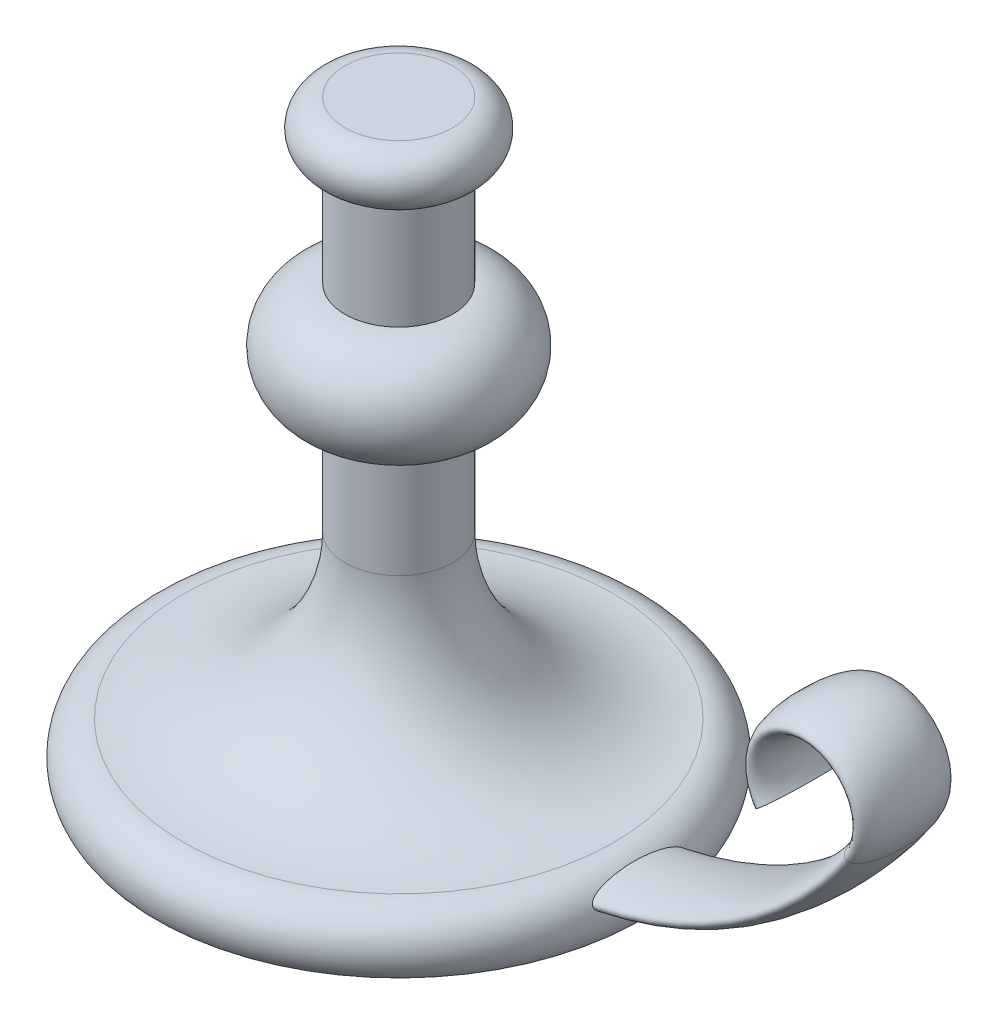
ISO-10303-21;
HEADER;
FILE_DESCRIPTION(('STEP AP214'),'2;1');
FILE_NAME('part.step','',(''),(''),'','','');
FILE_SCHEMA(('AUTOMOTIVE_DESIGN { 1 0 10303 214 1 1 1 1 }'));
ENDSEC;
DATA;
#1=APPLICATION_CONTEXT('core data for automotive mechanical design processes');
#2=APPLICATION_PROTOCOL_DEFINITION('international standard','automotive_design',2000,#1);
#3=PRODUCT_CONTEXT('',#1,'mechanical');
#4=PRODUCT('Part','Part','',(#3));
#5=PRODUCT_RELATED_PRODUCT_CATEGORY('part','',(#4));
#6=PRODUCT_DEFINITION_FORMATION('','',#4);
#7=PRODUCT_DEFINITION_CONTEXT('part definition',#1,'design');
#8=PRODUCT_DEFINITION('design','',#6,#7);
#9=PRODUCT_DEFINITION_SHAPE('','',#8);
#10=(LENGTH_UNIT() NAMED_UNIT(*) SI_UNIT(.MILLI.,.METRE.));
#11=(NAMED_UNIT(*) PLANE_ANGLE_UNIT() SI_UNIT($,.RADIAN.));
#12=(NAMED_UNIT(*) SI_UNIT($,.STERADIAN.) SOLID_ANGLE_UNIT());
#13=UNCERTAINTY_MEASURE_WITH_UNIT(LENGTH_MEASURE(1.E-05),#10,'distance_accuracy_value','');
#14=(GEOMETRIC_REPRESENTATION_CONTEXT(3) GLOBAL_UNCERTAINTY_ASSIGNED_CONTEXT((#13)) GLOBAL_UNIT_ASSIGNED_CONTEXT((#10,
#11,#12)) REPRESENTATION_CONTEXT('',''));
#15=CARTESIAN_POINT('',(0.,0.,0.));
#16=DIRECTION('',(0.,0.,1.));
#17=DIRECTION('',(1.,0.,0.));
#18=AXIS2_PLACEMENT_3D('',#15,#16,#17);
#19=CARTESIAN_POINT('',(0.,220.,0.));
#20=DIRECTION('',(0.,1.,0.));
#21=DIRECTION('',(0.,0.,1.));
#22=AXIS2_PLACEMENT_3D('',#19,#20,#21);
#23=PLANE('',#22);
#24=CARTESIAN_POINT('',(0.,220.,0.));
#25=DIRECTION('',(0.,-1.,0.));
#26=DIRECTION('',(0.,0.,-1.));
#27=AXIS2_PLACEMENT_3D('',#24,#25,#26);
#28=CIRCLE('',#27,20.);
#29=CARTESIAN_POINT('',(0.,220.,-20.));
#30=VERTEX_POINT('',#29);
#31=EDGE_CURVE('E40',#30,#30,#28,.T.);
#32=ORIENTED_EDGE('',*,*,#31,.F.);
#33=EDGE_LOOP('',(#32));
#34=FACE_BOUND('',#33,.T.);
#35=ADVANCED_FACE('F30',(#34),#23,.T.);
#36=CARTESIAN_POINT('',(0.,210.,0.));
#37=DIRECTION('',(0.,-1.,0.));
#38=DIRECTION('',(0.,0.,-1.));
#39=AXIS2_PLACEMENT_3D('',#36,#37,#38);
#40=TOROIDAL_SURFACE('',#39,20.,10.);
#41=ORIENTED_EDGE('',*,*,#31,.T.);
#42=EDGE_LOOP('',(#41));
#43=FACE_BOUND('',#42,.T.);
#44=CARTESIAN_POINT('',(0.,200.,0.));
#45=DIRECTION('',(0.,-1.,0.));
#46=DIRECTION('',(0.,0.,-1.));
#47=AXIS2_PLACEMENT_3D('',#44,#45,#46);
#48=CIRCLE('',#47,20.);
#49=CARTESIAN_POINT('',(0.,200.,-20.));
#50=VERTEX_POINT('',#49);
#51=EDGE_CURVE('E44',#50,#50,#48,.T.);
#52=ORIENTED_EDGE('',*,*,#51,.F.);
#53=EDGE_LOOP('',(#52));
#54=FACE_BOUND('',#53,.T.);
#55=ADVANCED_FACE('F103',(#43,#54),#40,.T.);
#56=CARTESIAN_POINT('',(0.,0.,0.));
#57=DIRECTION('',(0.,-1.,0.));
#58=DIRECTION('',(0.,0.,-1.));
#59=AXIS2_PLACEMENT_3D('',#56,#57,#58);
#60=CYLINDRICAL_SURFACE('',#59,20.);
#61=ORIENTED_EDGE('',*,*,#51,.T.);
#62=EDGE_LOOP('',(#61));
#63=FACE_BOUND('',#62,.T.);
#64=CARTESIAN_POINT('',(0.,160.,0.));
#65=DIRECTION('',(0.,-1.,0.));
#66=DIRECTION('',(0.,0.,-1.));
#67=AXIS2_PLACEMENT_3D('',#64,#65,#66);
#68=CIRCLE('',#67,20.);
#69=CARTESIAN_POINT('',(0.,160.,-20.));
#70=VERTEX_POINT('',#69);
#71=EDGE_CURVE('E48',#70,#70,#68,.T.);
#72=ORIENTED_EDGE('',*,*,#71,.F.);
#73=EDGE_LOOP('',(#72));
#74=FACE_BOUND('',#73,.T.);
#75=ADVANCED_FACE('F100',(#63,#74),#60,.T.);
#76=CARTESIAN_POINT('',(0.,140.,0.));
#77=DIRECTION('',(0.,-1.,0.));
#78=DIRECTION('',(0.,0.,-1.));
#79=AXIS2_PLACEMENT_3D('',#76,#77,#78);
#80=DEGENERATE_TOROIDAL_SURFACE('',#79,20.,20.,.T.);
#81=ORIENTED_EDGE('',*,*,#71,.T.);
#82=EDGE_LOOP('',(#81));
#83=FACE_BOUND('',#82,.T.);
#84=CARTESIAN_POINT('',(0.,120.,0.));
#85=DIRECTION('',(0.,-1.,0.));
#86=DIRECTION('',(0.,0.,-1.));
#87=AXIS2_PLACEMENT_3D('',#84,#85,#86);
#88=CIRCLE('',#87,20.);
#89=CARTESIAN_POINT('',(0.,120.,-20.));
#90=VERTEX_POINT('',#89);
#91=EDGE_CURVE('E53',#90,#90,#88,.T.);
#92=ORIENTED_EDGE('',*,*,#91,.F.);
#93=EDGE_LOOP('',(#92));
#94=FACE_BOUND('',#93,.T.);
#95=ADVANCED_FACE('F96',(#83,#94),#80,.T.);
#96=CARTESIAN_POINT('',(0.,0.,0.));
#97=DIRECTION('',(0.,-1.,0.));
#98=DIRECTION('',(0.,0.,-1.));
#99=AXIS2_PLACEMENT_3D('',#96,#97,#98);
#100=CYLINDRICAL_SURFACE('',#99,20.);
#101=ORIENTED_EDGE('',*,*,#91,.T.);
#102=EDGE_LOOP('',(#101));
#103=FACE_BOUND('',#102,.T.);
#104=CARTESIAN_POINT('',(0.,80.,0.));
#105=DIRECTION('',(0.,-1.,0.));
#106=DIRECTION('',(0.,0.,-1.));
#107=AXIS2_PLACEMENT_3D('',#104,#105,#106);
#108=CIRCLE('',#107,20.);
#109=CARTESIAN_POINT('',(0.,80.,-20.));
#110=VERTEX_POINT('',#109);
#111=EDGE_CURVE('E56',#110,#110,#108,.T.);
#112=ORIENTED_EDGE('',*,*,#111,.F.);
#113=EDGE_LOOP('',(#112));
#114=FACE_BOUND('',#113,.T.);
#115=ADVANCED_FACE('F92',(#103,#114),#100,.T.);
#116=CARTESIAN_POINT('',(0.,80.,0.));
#117=DIRECTION('',(0.,-1.,0.));
#118=DIRECTION('',(0.,0.,-1.));
#119=AXIS2_PLACEMENT_3D('',#116,#117,#118);
#120=TOROIDAL_SURFACE('',#119,80.,60.);
#121=ORIENTED_EDGE('',*,*,#111,.T.);
#122=EDGE_LOOP('',(#121));
#123=FACE_BOUND('',#122,.T.);
#124=CARTESIAN_POINT('',(0.,20.,0.));
#125=DIRECTION('',(0.,-1.,0.));
#126=DIRECTION('',(0.,0.,-1.));
#127=AXIS2_PLACEMENT_3D('',#124,#125,#126);
#128=CIRCLE('',#127,80.);
#129=CARTESIAN_POINT('',(0.,20.,-80.));
#130=VERTEX_POINT('',#129);
#131=EDGE_CURVE('E59',#130,#130,#128,.T.);
#132=ORIENTED_EDGE('',*,*,#131,.F.);
#133=EDGE_LOOP('',(#132));
#134=FACE_BOUND('',#133,.T.);
#135=ADVANCED_FACE('F88',(#123,#134),#120,.F.);
#136=CARTESIAN_POINT('',(0.,7.49999999999996,0.));
#137=DIRECTION('',(0.,-1.,0.));
#138=DIRECTION('',(0.,0.,-1.));
#139=AXIS2_PLACEMENT_3D('',#136,#137,#138);
#140=TOROIDAL_SURFACE('',#139,80.,12.5);
#141=CARTESIAN_POINT('',(89.5597422043341,12.9414346567555,-17.5));
#142=CARTESIAN_POINT('',(89.5390682417034,12.9833970763635,-17.499999801476));
#143=CARTESIAN_POINT('',(89.5184948481192,13.0254081758614,-17.4978460786372));
#144=CARTESIAN_POINT('',(89.4777074557659,13.1091783719493,-17.4892930018231));
#145=CARTESIAN_POINT('',(89.4574935851384,13.1509373753176,-17.4828921640349));
#146=CARTESIAN_POINT('',(89.3975656488551,13.275424618129,-17.4575317742508));
#147=CARTESIAN_POINT('',(89.3585930347989,13.3573066164348,-17.4324146791396));
#148=CARTESIAN_POINT('',(89.2734409816765,13.5379175715786,-17.3597432795598));
#149=CARTESIAN_POINT('',(89.2281121247516,13.6353143232492,-17.3079911474061));
#150=CARTESIAN_POINT('',(89.1421571121494,13.8217561384483,-17.1881660796029));
#151=CARTESIAN_POINT('',(89.1015411563844,13.9107830112797,-17.1200586894138));
#152=CARTESIAN_POINT('',(89.0298762971165,14.0690143319055,-16.9825248110394));
#153=CARTESIAN_POINT('',(88.9982786842444,14.1392645151032,-16.914552922541));
#154=CARTESIAN_POINT('',(88.9378306664439,14.274320374163,-16.7722185271801));
#155=CARTESIAN_POINT('',(88.9089824882068,14.3391216321741,-16.6978509317862));
#156=CARTESIAN_POINT('',(88.8535955575884,14.4639952815647,-16.5441752211162));
#157=CARTESIAN_POINT('',(88.8270622241569,14.5240565470722,-16.4648562214599));
#158=CARTESIAN_POINT('',(88.7760324990848,14.639869406975,-16.302568916961));
#159=CARTESIAN_POINT('',(88.7515354717387,14.6956223459826,-16.2196017634806));
#160=CARTESIAN_POINT('',(88.7047417294346,14.8022966462375,-16.0524591820991));
#161=CARTESIAN_POINT('',(88.6824111309147,14.8532916472492,-15.9683399173081));
#162=CARTESIAN_POINT('',(88.6391880618339,14.9520793339758,-15.7978736183898));
#163=CARTESIAN_POINT('',(88.6182958325685,14.9998714823563,-15.711526213802));
#164=CARTESIAN_POINT('',(88.5574287556144,15.1391199588384,-15.4495202070299));
#165=CARTESIAN_POINT('',(88.5193306885352,15.2262946979451,-15.27114460934));
#166=CARTESIAN_POINT('',(88.4469930849529,15.3914560839504,-14.9093240436533));
#167=CARTESIAN_POINT('',(88.4127567918463,15.469435010004,-14.7258749732313));
#168=CARTESIAN_POINT('',(88.3472362016712,15.6180770700464,-14.3544014869795));
#169=CARTESIAN_POINT('',(88.3159681826397,15.6887000486785,-14.1663582382778));
#170=CARTESIAN_POINT('',(88.2560646079384,15.8232632193264,-13.7877426015724));
#171=CARTESIAN_POINT('',(88.2274261580787,15.8872107694165,-13.5971732648845));
#172=CARTESIAN_POINT('',(88.1723521282147,16.0093779596916,-13.2139752998441));
#173=CARTESIAN_POINT('',(88.1459158137056,16.0675995109176,-13.0213473824977));
#174=CARTESIAN_POINT('',(88.088158719692,16.1938504755766,-12.5829461756589));
#175=CARTESIAN_POINT('',(88.0574088267969,16.260370117645,-12.3366637905581));
#176=CARTESIAN_POINT('',(87.998512318722,16.3864590847678,-11.8420048197327));
#177=CARTESIAN_POINT('',(87.9703659750278,16.4460276851698,-11.5936280185525));
#178=CARTESIAN_POINT('',(87.9163482586828,16.559094633045,-11.0949310622537));
#179=CARTESIAN_POINT('',(87.8904797303633,16.6125854146132,-10.844608890571));
#180=CARTESIAN_POINT('',(87.840848396567,16.7140512465656,-10.3426370646255));
#181=CARTESIAN_POINT('',(87.8170856939,16.7620260276843,-10.0909873461846));
#182=CARTESIAN_POINT('',(87.7486691228051,16.8985839230832,-9.33377768592024));
#183=CARTESIAN_POINT('',(87.7069540377652,16.9796608720202,-8.82658708532979));
#184=CARTESIAN_POINT('',(87.6306961124075,17.1248455016838,-7.80916406760087));
#185=CARTESIAN_POINT('',(87.5961551600074,17.1889487168834,-7.29893088603568));
#186=CARTESIAN_POINT('',(87.5339911377832,17.3022548727762,-6.27558535996604));
#187=CARTESIAN_POINT('',(87.5063790759951,17.3514341291622,-5.76246974165374));
#188=CARTESIAN_POINT('',(87.4581556376935,17.4361006629321,-4.7353382584016));
#189=CARTESIAN_POINT('',(87.437536937759,17.4716022688271,-4.22132390532637));
#190=CARTESIAN_POINT('',(87.4033485965416,17.5298933049628,-3.19263203564112));
#191=CARTESIAN_POINT('',(87.3897750436295,17.5526897899013,-2.67795504642657));
#192=CARTESIAN_POINT('',(87.3697503063743,17.586157334674,-1.64816415678529));
#193=CARTESIAN_POINT('',(87.3632979000101,17.5968304749383,-1.13305034650715));
#194=CARTESIAN_POINT('',(87.3567446403376,17.60768667733,0.0451925107317157));
#195=CARTESIAN_POINT('',(87.3589979794371,17.6039802512045,0.708375187514246));
#196=CARTESIAN_POINT('',(87.375360353613,17.5767998431172,2.03444017536955));
#197=CARTESIAN_POINT('',(87.3894738801435,17.5533183723369,2.69732227744721));
#198=CARTESIAN_POINT('',(87.4294012787109,17.4856044911543,4.02207693580599));
#199=CARTESIAN_POINT('',(87.4552221149227,17.4413597290139,4.68394865558109));
#200=CARTESIAN_POINT('',(87.5182601373715,17.3304493690436,6.0027308368197));
#201=CARTESIAN_POINT('',(87.5554327085336,17.2638714468585,6.65965058375502));
#202=CARTESIAN_POINT('',(87.6198336832519,17.1447808230942,7.64196457807243));
#203=CARTESIAN_POINT('',(87.6427357061842,17.1018902548715,7.96882803392581));
#204=CARTESIAN_POINT('',(87.6915021526186,17.0091104096812,8.62133363379508));
#205=CARTESIAN_POINT('',(87.7173664470654,16.9592214375871,8.94697583037891));
#206=CARTESIAN_POINT('',(87.7721755297609,16.8517641144643,9.5964635079253));
#207=CARTESIAN_POINT('',(87.8011178051597,16.7942020181557,9.92031023085026));
#208=CARTESIAN_POINT('',(87.8623401784718,16.6704243889998,10.5660151582732));
#209=CARTESIAN_POINT('',(87.8946200133661,16.6042095379314,10.8878735173506));
#210=CARTESIAN_POINT('',(87.9634236652185,16.4608004427519,11.5338084513021));
#211=CARTESIAN_POINT('',(88.0000038204032,16.3834565668021,11.8578460140804));
#212=CARTESIAN_POINT('',(88.0776704479078,16.216740296061,12.5024294932683));
#213=CARTESIAN_POINT('',(88.1187582871156,16.1273642508179,12.8229743179849));
#214=CARTESIAN_POINT('',(88.1845991136114,15.9822640377112,13.3001792679786));
#215=CARTESIAN_POINT('',(88.2072711562737,15.9320048353495,13.4587947763658));
#216=CARTESIAN_POINT('',(88.2542087743504,15.8273740345266,13.7744208617835));
#217=CARTESIAN_POINT('',(88.2784742329894,15.7730027373805,13.9314315554521));
#218=CARTESIAN_POINT('',(88.3288329339645,15.6596363065343,14.2433947335163));
#219=CARTESIAN_POINT('',(88.3549252454497,15.6006435258598,14.3983482189393));
#220=CARTESIAN_POINT('',(88.4092696388296,15.477335251748,14.7057236901218));
#221=CARTESIAN_POINT('',(88.4375213946568,15.4130205617773,14.8581460538564));
#222=CARTESIAN_POINT('',(88.4968507719835,15.2776562950144,15.160909192863));
#223=CARTESIAN_POINT('',(88.5279487218452,15.2065580859213,15.3112244481833));
#224=CARTESIAN_POINT('',(88.59338509948,15.0568677679769,15.6074204461953));
#225=CARTESIAN_POINT('',(88.6277241675818,14.9782741782747,15.7533003050532));
#226=CARTESIAN_POINT('',(88.7002441190648,14.8125407512948,16.0379741363738));
#227=CARTESIAN_POINT('',(88.7383996400963,14.7254574196207,16.1768067090639));
#228=CARTESIAN_POINT('',(88.7994889081862,14.5866042208357,16.3782369433198));
#229=CARTESIAN_POINT('',(88.8204977413191,14.5389415031675,16.4442523217239));
#230=CARTESIAN_POINT('',(88.863984505343,14.440558140034,16.5734496387383));
#231=CARTESIAN_POINT('',(88.8864621846808,14.3898380182915,16.6366320594092));
#232=CARTESIAN_POINT('',(88.9422432981277,14.2644224068548,16.7835876842836));
#233=CARTESIAN_POINT('',(88.9763364041354,14.188122461894,16.8657235531448));
#234=CARTESIAN_POINT('',(89.0483213192211,14.0281384901669,17.0203903295068));
#235=CARTESIAN_POINT('',(89.0862061390426,13.9444680822883,17.0929383574385));
#236=CARTESIAN_POINT('',(89.1670311583552,13.7675914637843,17.2256585134355));
#237=CARTESIAN_POINT('',(89.2100345714221,13.6742683967988,17.2856436508895));
#238=CARTESIAN_POINT('',(89.2779863638647,13.5285260537483,17.3610498966365));
#239=CARTESIAN_POINT('',(89.3011904906548,13.4790295982009,17.3837437830222));
#240=CARTESIAN_POINT('',(89.3486811224813,13.3783655416231,17.423581520814));
#241=CARTESIAN_POINT('',(89.3729671592217,13.3271986661342,17.4407277474295));
#242=CARTESIAN_POINT('',(89.4344831171645,13.1984825422779,17.4755813984569));
#243=CARTESIAN_POINT('',(89.4722908092752,13.1201458143837,17.4895469950746));
#244=CARTESIAN_POINT('',(89.5490629639967,12.9628453353451,17.5023227338008));
#245=CARTESIAN_POINT('',(89.588026903279,12.8838818793701,17.5011396310454));
#246=CARTESIAN_POINT('',(89.6659197904103,12.7278461407144,17.4839019863867));
#247=CARTESIAN_POINT('',(89.7048486189815,12.6507699944126,17.4678809909874));
#248=CARTESIAN_POINT('',(89.7818193498571,12.5001197626239,17.422713342349));
#249=CARTESIAN_POINT('',(89.8198603575269,12.4265491378854,17.3935540037525));
#250=CARTESIAN_POINT('',(89.9134049221874,12.2476534190946,17.3068893145748));
#251=CARTESIAN_POINT('',(89.9679590616007,12.1451898390012,17.2425093702041));
#252=CARTESIAN_POINT('',(90.0730473029291,11.950845333304,17.0967607254923));
#253=CARTESIAN_POINT('',(90.1235693401394,11.8589958245582,17.0153434992572));
#254=CARTESIAN_POINT('',(90.2171397045055,11.6912868202056,16.8474453840389));
#255=CARTESIAN_POINT('',(90.2604644261208,11.6147475285821,16.7617815283391));
#256=CARTESIAN_POINT('',(90.344182781736,11.4686468553514,16.5833011975381));
#257=CARTESIAN_POINT('',(90.3845736709555,11.3990919854176,16.4904781877951));
#258=CARTESIAN_POINT('',(90.4628381757591,11.2658377500096,16.2994188011832));
#259=CARTESIAN_POINT('',(90.5007060129798,11.2021517058692,16.2011708808882));
#260=CARTESIAN_POINT('',(90.5741373771319,11.0799532151586,16.0007631564083));
#261=CARTESIAN_POINT('',(90.6097017753865,11.02143880922,15.8986048549468));
#262=CARTESIAN_POINT('',(90.6798506810742,10.9071528014066,15.6881130904083));
#263=CARTESIAN_POINT('',(90.7143737156124,10.8515162836099,15.5796863140031));
#264=CARTESIAN_POINT('',(90.7815268547134,10.7443116806228,15.3602532814398));
#265=CARTESIAN_POINT('',(90.8141566222368,10.6927443192391,15.2492465708978));
#266=CARTESIAN_POINT('',(90.87776481347,10.5931040659553,15.0249916383735));
#267=CARTESIAN_POINT('',(90.908740525338,10.5450368683702,14.9117401290287));
#268=CARTESIAN_POINT('',(90.9691471982775,10.4520756013854,14.6835311743165));
#269=CARTESIAN_POINT('',(90.9985780215554,10.4071818149093,14.5685735779466));
#270=CARTESIAN_POINT('',(91.0847991405934,10.2766779068845,14.2214202083363));
#271=CARTESIAN_POINT('',(91.1394751820591,10.1953120661707,13.98709732981));
#272=CARTESIAN_POINT('',(91.2442711007061,10.0414382528798,13.5131955707619));
#273=CARTESIAN_POINT('',(91.2943656433947,9.96897885186609,13.2735956051788));
#274=CARTESIAN_POINT('',(91.3902100238857,9.83200733703528,12.7915919671414));
#275=CARTESIAN_POINT('',(91.4359646930122,9.76748636147579,12.5491917575773));
#276=CARTESIAN_POINT('',(91.523609648134,9.64522219888746,12.0620925005347));
#277=CARTESIAN_POINT('',(91.5655011282585,9.58747691594821,11.8173941893527));
#278=CARTESIAN_POINT('',(91.6521116126974,9.46924027933833,11.2872469347214));
#279=CARTESIAN_POINT('',(91.6962295704986,9.40975960215023,11.0014751279626));
#280=CARTESIAN_POINT('',(91.7801283472601,9.29775188889836,10.4279264531804));
#281=CARTESIAN_POINT('',(91.8199088096812,9.24522542439006,10.1401494223944));
#282=CARTESIAN_POINT('',(91.8954614399599,9.1463255918539,9.56268010525802));
#283=CARTESIAN_POINT('',(91.9312290206041,9.09995925467732,9.27298601995786));
#284=CARTESIAN_POINT('',(91.998927686402,9.01286744656209,8.6923001488062));
#285=CARTESIAN_POINT('',(92.0308586021344,8.97214222471448,8.40130830623573));
#286=CARTESIAN_POINT('',(92.1212362536776,8.85762649139965,7.52609730456425));
#287=CARTESIAN_POINT('',(92.1741858932293,8.79160214830781,6.94027690545248));
#288=CARTESIAN_POINT('',(92.2664432393117,8.67757998740941,5.7657032377167));
#289=CARTESIAN_POINT('',(92.3057471215811,8.6295872226936,5.17694919374727));
#290=CARTESIAN_POINT('',(92.3712614806819,8.55005786852944,3.99846267767355));
#291=CARTESIAN_POINT('',(92.3974906208558,8.51849781956544,3.40873281279764));
#292=CARTESIAN_POINT('',(92.437288766261,8.47075403182092,2.2287671311534));
#293=CARTESIAN_POINT('',(92.450869156561,8.45455646511548,1.63853224893877));
#294=CARTESIAN_POINT('',(92.4655827970142,8.43701196328792,0.458012213479796));
#295=CARTESIAN_POINT('',(92.4667228078028,8.43565696207794,-0.132272738112226));
#296=CARTESIAN_POINT('',(92.456589658858,8.44773292337706,-1.31245514851147));
#297=CARTESIAN_POINT('',(92.4453194307801,8.46116039384055,-1.90235266590985));
#298=CARTESIAN_POINT('',(92.4152323530409,8.49720127894358,-2.91293122100027));
#299=CARTESIAN_POINT('',(92.3994886339034,8.51609771327115,-3.33384169724629));
#300=CARTESIAN_POINT('',(92.3614792935764,8.56194763892276,-4.17492724048506));
#301=CARTESIAN_POINT('',(92.3392138048906,8.58890096655378,-4.59510232224449));
#302=CARTESIAN_POINT('',(92.2880200589754,8.65128092003614,-5.43403090744295));
#303=CARTESIAN_POINT('',(92.2590979157002,8.68669977167767,-5.852785359736));
#304=CARTESIAN_POINT('',(92.1943469782277,8.76665027126877,-6.68888197527413));
#305=CARTESIAN_POINT('',(92.1585184884714,8.81118151753701,-7.10622419994726));
#306=CARTESIAN_POINT('',(92.0913883463812,8.89546537402612,-7.81486574093702));
#307=CARTESIAN_POINT('',(92.0619223972687,8.93268360128217,-8.10664239635245));
#308=CARTESIAN_POINT('',(91.9992751831089,9.01244031978035,-8.68906573696367));
#309=CARTESIAN_POINT('',(91.9660940114581,9.05497867728352,-8.97971245037495));
#310=CARTESIAN_POINT('',(91.8958362735772,9.1458607932039,-9.55954014428284));
#311=CARTESIAN_POINT('',(91.8587608402615,9.19420286379342,-9.8487215255508));
#312=CARTESIAN_POINT('',(91.7804640728064,9.29733424331032,-10.4253680209447));
#313=CARTESIAN_POINT('',(91.7392428979844,9.3521233044992,-10.7128332005733));
#314=CARTESIAN_POINT('',(91.6651852642315,9.45169652539218,-11.2009114295609));
#315=CARTESIAN_POINT('',(91.6334740038764,9.49464812309406,-11.4020698754929));
#316=CARTESIAN_POINT('',(91.5676939042983,9.58452467571202,-11.8031075357756));
#317=CARTESIAN_POINT('',(91.5336251409588,9.63144950274826,-12.0029867910749));
#318=CARTESIAN_POINT('',(91.4629103530502,9.72978070272471,-12.401460723702));
#319=CARTESIAN_POINT('',(91.4262611401161,9.78119263933954,-12.6000534686469));
#320=CARTESIAN_POINT('',(91.3502044219489,9.88900570640091,-12.9953470629488));
#321=CARTESIAN_POINT('',(91.3107970144979,9.94540665999811,-13.192047979093));
#322=CARTESIAN_POINT('',(91.2276212473556,10.065822395827,-13.5894074367351));
#323=CARTESIAN_POINT('',(91.1837532035494,10.1300241281555,-13.7899888883966));
#324=CARTESIAN_POINT('',(91.0923799134082,10.2655141547585,-14.1878967143335));
#325=CARTESIAN_POINT('',(91.0448751095671,10.336801587212,-14.3852234810749));
#326=CARTESIAN_POINT('',(90.9457925667103,10.4876709265981,-14.775138637591));
#327=CARTESIAN_POINT('',(90.8942241714215,10.5672339324103,-14.9677366350237));
#328=CARTESIAN_POINT('',(90.786214344753,10.7366119201202,-15.3468982086159));
#329=CARTESIAN_POINT('',(90.7297756979387,10.8264210531349,-15.5334651502416));
#330=CARTESIAN_POINT('',(90.6212033814574,11.0023988323042,-15.866506496817));
#331=CARTESIAN_POINT('',(90.5700064097171,11.0865232525076,-16.0143454854259));
#332=CARTESIAN_POINT('',(90.4894948368595,11.2210719601908,-16.2297682662906));
#333=CARTESIAN_POINT('',(90.4620005609598,11.2673801193616,-16.3006068507138));
#334=CARTESIAN_POINT('',(90.4056638817274,11.3631027215097,-16.4395882553652));
#335=CARTESIAN_POINT('',(90.3768217919433,11.4125164429381,-16.5077316958343));
#336=CARTESIAN_POINT('',(90.317300018798,11.515443110643,-16.6414688232417));
#337=CARTESIAN_POINT('',(90.2866026931904,11.5689974830602,-16.7070230259466));
#338=CARTESIAN_POINT('',(90.2235248416865,11.6801460587651,-16.8338288983775));
#339=CARTESIAN_POINT('',(90.191143758925,11.7377416008084,-16.8950791287088));
#340=CARTESIAN_POINT('',(90.1246746009072,11.8572287345063,-17.0118342639363));
#341=CARTESIAN_POINT('',(90.0905922975482,11.9191060427854,-17.0673568649558));
#342=CARTESIAN_POINT('',(90.0205945500734,12.0476162041275,-17.1711750807875));
#343=CARTESIAN_POINT('',(89.9846810936578,12.1142439306918,-17.2194783172348));
#344=CARTESIAN_POINT('',(89.9072691914926,12.2595601926731,-17.3112578352726));
#345=CARTESIAN_POINT('',(89.8655734433138,12.338786839305,-17.353750128747));
#346=CARTESIAN_POINT('',(89.8018195982635,12.4615624088558,-17.40644822226));
#347=CARTESIAN_POINT('',(89.7803859732818,12.5031053112467,-17.4221652201538));
#348=CARTESIAN_POINT('',(89.7372110357365,12.5873443591953,-17.4495428288991));
#349=CARTESIAN_POINT('',(89.7154698658757,12.630039977734,-17.4612052607443));
#350=CARTESIAN_POINT('',(89.671374074068,12.717210960285,-17.4803130763973));
#351=CARTESIAN_POINT('',(89.6490160377554,12.7617048684907,-17.4876666954986));
#352=CARTESIAN_POINT('',(89.6043139799338,12.8512585298273,-17.497511032234));
#353=CARTESIAN_POINT('',(89.5819699650803,12.8963184572131,-17.5000002134446));
#354=CARTESIAN_POINT('',(89.5597422043341,12.9414346567555,-17.5));
#355=B_SPLINE_CURVE_WITH_KNOTS('',3,(#141,#142,#143,#144,#145,#146,#147,#148,#149,#150,#151,
#152,#153,#154,#155,#156,#157,#158,#159,#160,#161,#162,#163,#164,#165,#166,#167,#168,#169,#170,
#171,#172,#173,#174,#175,#176,#177,#178,#179,#180,#181,#182,#183,#184,#185,#186,#187,#188,#189,
#190,#191,#192,#193,#194,#195,#196,#197,#198,#199,#200,#201,#202,#203,#204,#205,#206,#207,#208,
#209,#210,#211,#212,#213,#214,#215,#216,#217,#218,#219,#220,#221,#222,#223,#224,#225,#226,#227,
#228,#229,#230,#231,#232,#233,#234,#235,#236,#237,#238,#239,#240,#241,#242,#243,#244,#245,#246,
#247,#248,#249,#250,#251,#252,#253,#254,#255,#256,#257,#258,#259,#260,#261,#262,#263,#264,#265,
#266,#267,#268,#269,#270,#271,#272,#273,#274,#275,#276,#277,#278,#279,#280,#281,#282,#283,#284,
#285,#286,#287,#288,#289,#290,#291,#292,#293,#294,#295,#296,#297,#298,#299,#300,#301,#302,#303,
#304,#305,#306,#307,#308,#309,#310,#311,#312,#313,#314,#315,#316,#317,#318,#319,#320,#321,#322,
#323,#324,#325,#326,#327,#328,#329,#330,#331,#332,#333,#334,#335,#336,#337,#338,#339,#340,#341,
#342,#343,#344,#345,#346,#347,#348,#349,#350,#351,#352,#353,#354),.UNSPECIFIED.,.T.,.F.,(4,2,2,
2,2,2,2,2,2,2,2,2,2,2,2,2,2,2,2,2,2,2,2,2,2,2,2,2,2,2,2,2,2,2,2,2,2,2,2,2,2,2,2,2,2,2,2,2,2,2,2,
2,2,2,2,2,2,2,2,2,2,2,2,2,2,2,2,2,2,2,2,2,2,2,2,2,2,2,2,2,2,2,2,2,2,2,2,2,2,2,2,2,2,2,2,2,2,2,2,
2,2,2,2,2,2,2,4),(0.,0.14028211001699,0.280613256161175,0.561461564225122,0.917223769341701,
1.27374211332869,1.58149644875513,1.88949794489938,2.19820212539507,2.50680956807617,
2.80932632770106,3.11189371339093,3.7179212908607,4.32445412269174,4.93414127512162,
5.54314913395241,6.15195304286674,6.92267401303111,7.69347525989578,8.46522575436426,
9.23701390615475,10.7825344609024,12.3284612151262,13.8768286753826,15.4235696486737,
16.969450914329,18.5150668584841,20.5042466673057,22.4941801183619,24.4852988514038,
26.4686905809753,27.4599989065261,28.4512640608203,29.4417260743127,30.4321100930479,
31.4373321749637,32.4428599224087,32.9465835692657,33.4502703412865,33.9537023077338,
34.457058407552,34.9643418344998,35.4717256930946,35.9759372580709,36.2281107568714,
36.4802411812975,36.8312072460122,37.181537891102,37.5367612141414,37.7140754934841,
37.8913137556285,38.1543004158624,38.4171698086841,38.6794463357411,38.9419766409742,
39.3379141865737,39.7349951838536,40.1027739065801,40.4708923916026,40.839826864639,
41.2086209555906,41.5884869462989,41.9684203545894,42.348958660885,42.7295308511603,
43.4911928834784,44.2568399239456,45.0216243573322,45.7861715944424,46.6716652705776,
47.5572316788852,48.4438002994982,49.3304080552691,51.1055666497223,52.8812223364762,
54.6543360799368,56.4258523069528,58.1964057681377,59.9665410633261,61.231311473161,
62.4960561882252,63.7596438732034,65.0231758702622,65.9099510809318,66.7967040040702,
67.6831996648298,68.5696612713394,69.1939827801977,69.8182842026715,70.4433710179971,
71.0684356842848,71.7136688505138,72.3588236339872,73.0025359817082,73.64588269512,
74.178256172805,74.4451297056755,74.7119414605249,74.9818957428883,75.2519398816355,
75.5211229919217,75.7900198815108,76.086143967003,76.2339465299919,76.381682625624,
76.5324603376634,76.6832856648701),.UNSPECIFIED.);
#356=CARTESIAN_POINT('',(89.5597422043341,12.9414346567555,-17.5));
#357=VERTEX_POINT('',#356);
#358=EDGE_CURVE('E10',#357,#357,#355,.T.);
#359=ORIENTED_EDGE('',*,*,#358,.F.);
#360=EDGE_LOOP('',(#359));
#361=FACE_BOUND('',#360,.T.);
#362=ORIENTED_EDGE('',*,*,#131,.T.);
#363=EDGE_LOOP('',(#362));
#364=FACE_BOUND('',#363,.T.);
#365=CARTESIAN_POINT('',(0.,0.,0.));
#366=DIRECTION('',(0.,-1.,0.));
#367=DIRECTION('',(0.,0.,-1.));
#368=AXIS2_PLACEMENT_3D('',#365,#366,#367);
#369=CIRCLE('',#368,90.);
#370=CARTESIAN_POINT('',(0.,0.,-90.));
#371=VERTEX_POINT('',#370);
#372=EDGE_CURVE('E62',#371,#371,#369,.T.);
#373=ORIENTED_EDGE('',*,*,#372,.F.);
#374=EDGE_LOOP('',(#373));
#375=FACE_BOUND('',#374,.T.);
#376=ADVANCED_FACE('F83',(#361,#364,#375),#140,.T.);
#377=CARTESIAN_POINT('',(0.,0.,0.));
#378=DIRECTION('',(0.,-1.,0.));
#379=DIRECTION('',(0.,0.,-1.));
#380=AXIS2_PLACEMENT_3D('',#377,#378,#379);
#381=PLANE('',#380);
#382=ORIENTED_EDGE('',*,*,#372,.T.);
#383=EDGE_LOOP('',(#382));
#384=FACE_BOUND('',#383,.T.);
#385=ADVANCED_FACE('F78',(#384),#381,.T.);
#386=CARTESIAN_POINT('',(183.592070943083,75.,0.));
#387=DIRECTION('',(0.566666666666667,0.823947139620551,0.));
#388=DIRECTION('',(0.,0.,-1.));
#389=AXIS2_PLACEMENT_3D('',#386,#387,#388);
#390=ELLIPSE('',#389,17.5,5.);
#391=CARTESIAN_POINT('',(167.113128150672,86.3333333333333,0.));
#392=DIRECTION('',(0.,0.,1.));
#393=AXIS1_PLACEMENT('',#391,#392);
#394=SURFACE_OF_REVOLUTION('',#390,#393);
#395=CARTESIAN_POINT('',(183.592070943083,75.,-17.5));
#396=VERTEX_POINT('',#395);
#397=EDGE_CURVE('E68',#396,#396,#390,.T.);
#398=ORIENTED_EDGE('',*,*,#397,.T.);
#399=EDGE_LOOP('',(#398));
#400=FACE_BOUND('',#399,.T.);
#401=CARTESIAN_POINT('',(150.634185358261,74.9999999999997,0.));
#402=DIRECTION('',(0.566666666666678,-0.823947139620544,0.));
#403=DIRECTION('',(0.,0.,-1.));
#404=AXIS2_PLACEMENT_3D('',#401,#402,#403);
#405=ELLIPSE('',#404,17.5,5.);
#406=CARTESIAN_POINT('',(150.634185358261,74.9999999999997,-17.5));
#407=VERTEX_POINT('',#406);
#408=EDGE_CURVE('E65',#407,#407,#405,.T.);
#409=ORIENTED_EDGE('',*,*,#408,.F.);
#410=EDGE_LOOP('',(#409));
#411=FACE_BOUND('',#410,.T.);
#412=ADVANCED_FACE('F74',(#400,#411),#394,.F.);
#413=CARTESIAN_POINT('',(60.,9.99999999999999,0.));
#414=DIRECTION('',(1.,0.,0.));
#415=DIRECTION('',(0.,0.,-1.));
#416=AXIS2_PLACEMENT_3D('',#413,#414,#415);
#417=ELLIPSE('',#416,17.5,5.);
#418=CARTESIAN_POINT('',(60.,160.,0.));
#419=DIRECTION('',(0.,0.,1.));
#420=AXIS1_PLACEMENT('',#418,#419);
#421=SURFACE_OF_REVOLUTION('',#417,#420);
#422=ORIENTED_EDGE('',*,*,#358,.T.);
#423=EDGE_LOOP('',(#422));
#424=FACE_BOUND('',#423,.T.);
#425=ORIENTED_EDGE('',*,*,#397,.F.);
#426=EDGE_LOOP('',(#425));
#427=FACE_BOUND('',#426,.T.);
#428=ADVANCED_FACE('F77',(#424,#427),#421,.F.);
#429=CARTESIAN_POINT('',(150.634185358261,74.9999999999997,0.));
#430=DIRECTION('',(0.566666666666678,-0.823947139620544,0.));
#431=DIRECTION('',(0.,0.,-1.));
#432=AXIS2_PLACEMENT_3D('',#429,#430,#431);
#433=PLANE('',#432);
#434=ORIENTED_EDGE('',*,*,#408,.T.);
#435=EDGE_LOOP('',(#434));
#436=FACE_BOUND('',#435,.T.);
#437=ADVANCED_FACE('F180',(#436),#433,.T.);
#438=CLOSED_SHELL('',(#35,#55,#75,#95,#115,#135,#376,#385,#412,#428,#437));
#439=MANIFOLD_SOLID_BREP('B2',#438);
#440=ADVANCED_BREP_SHAPE_REPRESENTATION('',(#18,#439),#14);
#441=SHAPE_DEFINITION_REPRESENTATION(#9,#440);
ENDSEC;
END-ISO-10303-21;
